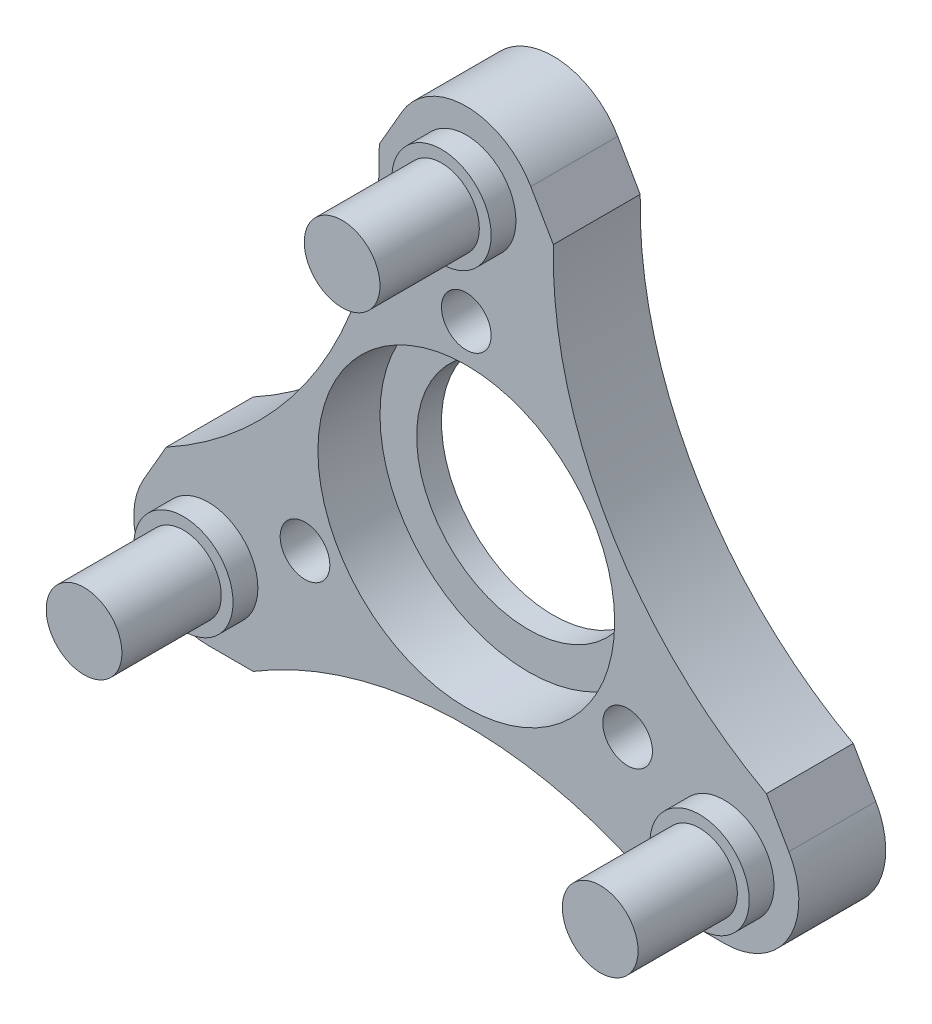
ISO-10303-21;
HEADER;
FILE_DESCRIPTION(('STEP AP214'),'2;1');
FILE_NAME('part.step','',(''),(''),'','','');
FILE_SCHEMA(('AUTOMOTIVE_DESIGN { 1 0 10303 214 1 1 1 1 }'));
ENDSEC;
DATA;
#1=APPLICATION_CONTEXT('core data for automotive mechanical design processes');
#2=APPLICATION_PROTOCOL_DEFINITION('international standard','automotive_design',2000,#1);
#3=PRODUCT_CONTEXT('',#1,'mechanical');
#4=PRODUCT('Part','Part','',(#3));
#5=PRODUCT_RELATED_PRODUCT_CATEGORY('part','',(#4));
#6=PRODUCT_DEFINITION_FORMATION('','',#4);
#7=PRODUCT_DEFINITION_CONTEXT('part definition',#1,'design');
#8=PRODUCT_DEFINITION('design','',#6,#7);
#9=PRODUCT_DEFINITION_SHAPE('','',#8);
#10=(LENGTH_UNIT() NAMED_UNIT(*) SI_UNIT(.MILLI.,.METRE.));
#11=(NAMED_UNIT(*) PLANE_ANGLE_UNIT() SI_UNIT($,.RADIAN.));
#12=(NAMED_UNIT(*) SI_UNIT($,.STERADIAN.) SOLID_ANGLE_UNIT());
#13=UNCERTAINTY_MEASURE_WITH_UNIT(LENGTH_MEASURE(1.E-05),#10,'distance_accuracy_value','');
#14=(GEOMETRIC_REPRESENTATION_CONTEXT(3) GLOBAL_UNCERTAINTY_ASSIGNED_CONTEXT((#13)) GLOBAL_UNIT_ASSIGNED_CONTEXT((#10,
#11,#12)) REPRESENTATION_CONTEXT('',''));
#15=CARTESIAN_POINT('',(0.,0.,0.));
#16=DIRECTION('',(0.,0.,1.));
#17=DIRECTION('',(1.,0.,0.));
#18=AXIS2_PLACEMENT_3D('',#15,#16,#17);
#19=CARTESIAN_POINT('',(7.79422863405997,4.50000000000006,2.5));
#20=DIRECTION('',(-0.866025403784436,-0.500000000000004,0.));
#21=DIRECTION('',(0.500000000000004,-0.866025403784436,0.));
#22=AXIS2_PLACEMENT_3D('',#19,#20,#21);
#23=PLANE('',#22);
#24=DIRECTION('',(0.500000000000004,-0.866025403784436,0.));
#25=VECTOR('',#24,1.);
#26=CARTESIAN_POINT('',(2.59807621135331,13.5,-1.));
#27=LINE('',#26,#25);
#28=CARTESIAN_POINT('',(12.0840089455446,-2.93011745279982,-1.));
#29=VERTEX_POINT('',#28);
#30=CARTESIAN_POINT('',(12.9903810567666,-4.49999999999989,-1.));
#31=VERTEX_POINT('',#30);
#32=EDGE_CURVE('E281',#29,#31,#27,.T.);
#33=ORIENTED_EDGE('',*,*,#32,.F.);
#34=DIRECTION('',(0.,0.,1.));
#35=VECTOR('',#34,1.);
#36=CARTESIAN_POINT('',(12.0840089455446,-2.93011745279982,-7.5));
#37=LINE('',#36,#35);
#38=CARTESIAN_POINT('',(12.0840089455446,-2.93011745279982,2.5));
#39=VERTEX_POINT('',#38);
#40=EDGE_CURVE('E107',#29,#39,#37,.T.);
#41=ORIENTED_EDGE('',*,*,#40,.T.);
#42=DIRECTION('',(-0.500000000000004,0.866025403784436,0.));
#43=VECTOR('',#42,1.);
#44=CARTESIAN_POINT('',(7.79422863405997,4.50000000000006,2.5));
#45=LINE('',#44,#43);
#46=CARTESIAN_POINT('',(12.9903810567666,-4.49999999999989,2.5));
#47=VERTEX_POINT('',#46);
#48=EDGE_CURVE('E208',#47,#39,#45,.T.);
#49=ORIENTED_EDGE('',*,*,#48,.F.);
#50=DIRECTION('',(0.,0.,-1.));
#51=VECTOR('',#50,1.);
#52=CARTESIAN_POINT('',(12.9903810567666,-4.49999999999989,2.5));
#53=LINE('',#52,#51);
#54=EDGE_CURVE('E227',#47,#31,#53,.T.);
#55=ORIENTED_EDGE('',*,*,#54,.T.);
#56=EDGE_LOOP('',(#33,#41,#49,#55));
#57=FACE_BOUND('',#56,.T.);
#58=ADVANCED_FACE('F92',(#57),#23,.F.);
#59=CARTESIAN_POINT('',(-7.7942286340599,4.49999999999987,2.5));
#60=DIRECTION('',(0.866025403784444,-0.499999999999991,0.));
#61=DIRECTION('',(0.499999999999991,0.866025403784444,0.));
#62=AXIS2_PLACEMENT_3D('',#59,#60,#61);
#63=PLANE('',#62);
#64=DIRECTION('',(0.499999999999991,0.866025403784444,0.));
#65=VECTOR('',#64,1.);
#66=CARTESIAN_POINT('',(-12.9903810567663,-4.49999999999993,-1.));
#67=LINE('',#66,#65);
#68=CARTESIAN_POINT('',(-3.50444832257553,11.9301174527996,-1.));
#69=VERTEX_POINT('',#68);
#70=CARTESIAN_POINT('',(-2.59807621135333,13.5,-1.));
#71=VERTEX_POINT('',#70);
#72=EDGE_CURVE('E194',#69,#71,#67,.T.);
#73=ORIENTED_EDGE('',*,*,#72,.F.);
#74=DIRECTION('',(0.,0.,1.));
#75=VECTOR('',#74,1.);
#76=CARTESIAN_POINT('',(-3.50444832257553,11.9301174527996,-7.5));
#77=LINE('',#76,#75);
#78=CARTESIAN_POINT('',(-3.50444832257553,11.9301174527996,2.5));
#79=VERTEX_POINT('',#78);
#80=EDGE_CURVE('E115',#69,#79,#77,.T.);
#81=ORIENTED_EDGE('',*,*,#80,.T.);
#82=DIRECTION('',(-0.499999999999991,-0.866025403784444,0.));
#83=VECTOR('',#82,1.);
#84=CARTESIAN_POINT('',(-7.7942286340599,4.49999999999987,2.5));
#85=LINE('',#84,#83);
#86=CARTESIAN_POINT('',(-2.59807621135333,13.5,2.5));
#87=VERTEX_POINT('',#86);
#88=EDGE_CURVE('E192',#87,#79,#85,.T.);
#89=ORIENTED_EDGE('',*,*,#88,.F.);
#90=DIRECTION('',(0.,0.,-1.));
#91=VECTOR('',#90,1.);
#92=CARTESIAN_POINT('',(-2.59807621135333,13.5,2.5));
#93=LINE('',#92,#91);
#94=EDGE_CURVE('E214',#87,#71,#93,.T.);
#95=ORIENTED_EDGE('',*,*,#94,.T.);
#96=EDGE_LOOP('',(#73,#81,#89,#95));
#97=FACE_BOUND('',#96,.T.);
#98=ADVANCED_FACE('F190',(#97),#63,.F.);
#99=CARTESIAN_POINT('',(0.,-8.9999999999999,2.5));
#100=DIRECTION('',(0.,1.,0.));
#101=DIRECTION('',(0.,0.,1.));
#102=AXIS2_PLACEMENT_3D('',#99,#100,#101);
#103=PLANE('',#102);
#104=DIRECTION('',(-1.,0.,0.));
#105=VECTOR('',#104,1.);
#106=CARTESIAN_POINT('',(10.3923048454133,-8.9999999999999,-1.));
#107=LINE('',#106,#105);
#108=CARTESIAN_POINT('',(-8.5795606229692,-8.9999999999999,-1.));
#109=VERTEX_POINT('',#108);
#110=CARTESIAN_POINT('',(-10.392304845413,-8.9999999999999,-1.));
#111=VERTEX_POINT('',#110);
#112=EDGE_CURVE('E353',#109,#111,#107,.T.);
#113=ORIENTED_EDGE('',*,*,#112,.F.);
#114=DIRECTION('',(0.,0.,1.));
#115=VECTOR('',#114,1.);
#116=CARTESIAN_POINT('',(-8.5795606229692,-8.9999999999999,-7.5));
#117=LINE('',#116,#115);
#118=CARTESIAN_POINT('',(-8.5795606229692,-8.9999999999999,2.5));
#119=VERTEX_POINT('',#118);
#120=EDGE_CURVE('E336',#109,#119,#117,.T.);
#121=ORIENTED_EDGE('',*,*,#120,.T.);
#122=DIRECTION('',(1.,0.,0.));
#123=VECTOR('',#122,1.);
#124=CARTESIAN_POINT('',(0.,-8.9999999999999,2.5));
#125=LINE('',#124,#123);
#126=CARTESIAN_POINT('',(-10.392304845413,-8.9999999999999,2.5));
#127=VERTEX_POINT('',#126);
#128=EDGE_CURVE('E308',#127,#119,#125,.T.);
#129=ORIENTED_EDGE('',*,*,#128,.F.);
#130=DIRECTION('',(0.,0.,-1.));
#131=VECTOR('',#130,1.);
#132=CARTESIAN_POINT('',(-10.392304845413,-8.9999999999999,2.5));
#133=LINE('',#132,#131);
#134=EDGE_CURVE('E206',#127,#111,#133,.T.);
#135=ORIENTED_EDGE('',*,*,#134,.T.);
#136=EDGE_LOOP('',(#113,#121,#129,#135));
#137=FACE_BOUND('',#136,.T.);
#138=ADVANCED_FACE('F376',(#137),#103,.F.);
#139=CARTESIAN_POINT('',(3.50444832257553,11.9301174527997,2.5));
#140=VERTEX_POINT('',#139);
#141=CARTESIAN_POINT('',(2.59807621135331,13.5,2.5));
#142=VERTEX_POINT('',#141);
#143=EDGE_CURVE('E273',#140,#142,#45,.T.);
#144=ORIENTED_EDGE('',*,*,#143,.F.);
#145=DIRECTION('',(0.,0.,1.));
#146=VECTOR('',#145,1.);
#147=CARTESIAN_POINT('',(3.50444832257553,11.9301174527997,-7.5));
#148=LINE('',#147,#146);
#149=CARTESIAN_POINT('',(3.50444832257553,11.9301174527997,-1.));
#150=VERTEX_POINT('',#149);
#151=EDGE_CURVE('E195',#140,#150,#148,.F.);
#152=ORIENTED_EDGE('',*,*,#151,.T.);
#153=CARTESIAN_POINT('',(2.59807621135331,13.5,-1.));
#154=VERTEX_POINT('',#153);
#155=EDGE_CURVE('E272',#154,#150,#27,.T.);
#156=ORIENTED_EDGE('',*,*,#155,.F.);
#157=DIRECTION('',(0.,0.,-1.));
#158=VECTOR('',#157,1.);
#159=CARTESIAN_POINT('',(2.59807621135331,13.5,2.5));
#160=LINE('',#159,#158);
#161=EDGE_CURVE('E224',#154,#142,#160,.F.);
#162=ORIENTED_EDGE('',*,*,#161,.T.);
#163=EDGE_LOOP('',(#144,#152,#156,#162));
#164=FACE_BOUND('',#163,.T.);
#165=ADVANCED_FACE('F271',(#164),#23,.F.);
#166=CARTESIAN_POINT('',(-12.0840089455441,-2.93011745279957,2.5));
#167=VERTEX_POINT('',#166);
#168=CARTESIAN_POINT('',(-12.9903810567663,-4.49999999999993,2.5));
#169=VERTEX_POINT('',#168);
#170=EDGE_CURVE('E203',#167,#169,#85,.T.);
#171=ORIENTED_EDGE('',*,*,#170,.F.);
#172=DIRECTION('',(0.,0.,1.));
#173=VECTOR('',#172,1.);
#174=CARTESIAN_POINT('',(-12.0840089455441,-2.93011745279957,-7.5));
#175=LINE('',#174,#173);
#176=CARTESIAN_POINT('',(-12.0840089455441,-2.93011745279957,-1.));
#177=VERTEX_POINT('',#176);
#178=EDGE_CURVE('E181',#167,#177,#175,.F.);
#179=ORIENTED_EDGE('',*,*,#178,.T.);
#180=CARTESIAN_POINT('',(-12.9903810567663,-4.49999999999993,-1.));
#181=VERTEX_POINT('',#180);
#182=EDGE_CURVE('E357',#181,#177,#67,.T.);
#183=ORIENTED_EDGE('',*,*,#182,.F.);
#184=DIRECTION('',(0.,0.,-1.));
#185=VECTOR('',#184,1.);
#186=CARTESIAN_POINT('',(-12.9903810567663,-4.49999999999993,2.5));
#187=LINE('',#186,#185);
#188=EDGE_CURVE('E216',#181,#169,#187,.F.);
#189=ORIENTED_EDGE('',*,*,#188,.T.);
#190=EDGE_LOOP('',(#171,#179,#183,#189));
#191=FACE_BOUND('',#190,.T.);
#192=ADVANCED_FACE('F378',(#191),#63,.F.);
#193=CARTESIAN_POINT('',(8.5795606229692,-8.9999999999999,2.5));
#194=VERTEX_POINT('',#193);
#195=CARTESIAN_POINT('',(10.3923048454133,-8.9999999999999,2.5));
#196=VERTEX_POINT('',#195);
#197=EDGE_CURVE('E307',#194,#196,#125,.T.);
#198=ORIENTED_EDGE('',*,*,#197,.F.);
#199=DIRECTION('',(0.,0.,1.));
#200=VECTOR('',#199,1.);
#201=CARTESIAN_POINT('',(8.5795606229692,-8.9999999999999,-7.5));
#202=LINE('',#201,#200);
#203=CARTESIAN_POINT('',(8.5795606229692,-8.9999999999999,-1.));
#204=VERTEX_POINT('',#203);
#205=EDGE_CURVE('E334',#194,#204,#202,.F.);
#206=ORIENTED_EDGE('',*,*,#205,.T.);
#207=CARTESIAN_POINT('',(10.3923048454133,-8.9999999999999,-1.));
#208=VERTEX_POINT('',#207);
#209=EDGE_CURVE('E321',#208,#204,#107,.T.);
#210=ORIENTED_EDGE('',*,*,#209,.F.);
#211=DIRECTION('',(0.,0.,-1.));
#212=VECTOR('',#211,1.);
#213=CARTESIAN_POINT('',(10.3923048454133,-8.9999999999999,2.5));
#214=LINE('',#213,#212);
#215=EDGE_CURVE('E202',#208,#196,#214,.F.);
#216=ORIENTED_EDGE('',*,*,#215,.T.);
#217=EDGE_LOOP('',(#198,#206,#210,#216));
#218=FACE_BOUND('',#217,.T.);
#219=ADVANCED_FACE('F319',(#218),#103,.F.);
#220=CARTESIAN_POINT('',(0.,0.,2.5));
#221=DIRECTION('',(0.,0.,1.));
#222=DIRECTION('',(1.,0.,0.));
#223=AXIS2_PLACEMENT_3D('',#220,#221,#222);
#224=PLANE('',#223);
#225=CARTESIAN_POINT('',(0.,-23.0940107675847,2.5));
#226=DIRECTION('',(0.,0.,1.));
#227=DIRECTION('',(1.,0.,0.));
#228=AXIS2_PLACEMENT_3D('',#225,#226,#227);
#229=CIRCLE('',#228,16.5);
#230=EDGE_CURVE('E315',#194,#119,#229,.T.);
#231=ORIENTED_EDGE('',*,*,#230,.F.);
#232=ORIENTED_EDGE('',*,*,#197,.T.);
#233=CARTESIAN_POINT('',(10.3923048454133,-5.9999999999999,2.5));
#234=DIRECTION('',(0.,0.,1.));
#235=DIRECTION('',(1.,0.,0.));
#236=AXIS2_PLACEMENT_3D('',#233,#234,#235);
#237=CIRCLE('',#236,3.);
#238=EDGE_CURVE('E220',#196,#47,#237,.T.);
#239=ORIENTED_EDGE('',*,*,#238,.T.);
#240=ORIENTED_EDGE('',*,*,#48,.T.);
#241=CARTESIAN_POINT('',(20.,11.5470053837925,2.5));
#242=DIRECTION('',(0.,0.,1.));
#243=DIRECTION('',(1.,0.,0.));
#244=AXIS2_PLACEMENT_3D('',#241,#242,#243);
#245=CIRCLE('',#244,16.5);
#246=EDGE_CURVE('E185',#140,#39,#245,.T.);
#247=ORIENTED_EDGE('',*,*,#246,.F.);
#248=ORIENTED_EDGE('',*,*,#143,.T.);
#249=CARTESIAN_POINT('',(0.,12.,2.5));
#250=DIRECTION('',(0.,0.,1.));
#251=DIRECTION('',(1.,0.,0.));
#252=AXIS2_PLACEMENT_3D('',#249,#250,#251);
#253=CIRCLE('',#252,3.);
#254=EDGE_CURVE('E201',#142,#87,#253,.T.);
#255=ORIENTED_EDGE('',*,*,#254,.T.);
#256=ORIENTED_EDGE('',*,*,#88,.T.);
#257=CARTESIAN_POINT('',(-20.,11.5470053837925,2.5));
#258=DIRECTION('',(0.,0.,1.));
#259=DIRECTION('',(1.,0.,0.));
#260=AXIS2_PLACEMENT_3D('',#257,#258,#259);
#261=CIRCLE('',#260,16.5);
#262=EDGE_CURVE('E178',#167,#79,#261,.T.);
#263=ORIENTED_EDGE('',*,*,#262,.F.);
#264=ORIENTED_EDGE('',*,*,#170,.T.);
#265=CARTESIAN_POINT('',(-10.392304845413,-5.9999999999999,2.5));
#266=DIRECTION('',(0.,0.,1.));
#267=DIRECTION('',(1.,0.,0.));
#268=AXIS2_PLACEMENT_3D('',#265,#266,#267);
#269=CIRCLE('',#268,3.);
#270=EDGE_CURVE('E222',#169,#127,#269,.T.);
#271=ORIENTED_EDGE('',*,*,#270,.T.);
#272=ORIENTED_EDGE('',*,*,#128,.T.);
#273=EDGE_LOOP('',(#231,#232,#239,#240,#247,#248,#255,#256,#263,#264,#271,#272));
#274=FACE_BOUND('',#273,.T.);
#275=CARTESIAN_POINT('',(0.,7.5,2.5));
#276=DIRECTION('',(0.,0.,1.));
#277=DIRECTION('',(1.,0.,0.));
#278=AXIS2_PLACEMENT_3D('',#275,#276,#277);
#279=CIRCLE('',#278,1.);
#280=CARTESIAN_POINT('',(1.,7.5,2.5));
#281=VERTEX_POINT('',#280);
#282=EDGE_CURVE('E255',#281,#281,#279,.T.);
#283=ORIENTED_EDGE('',*,*,#282,.F.);
#284=EDGE_LOOP('',(#283));
#285=FACE_BOUND('',#284,.T.);
#286=CARTESIAN_POINT('',(6.49519052838377,-3.74999999999972,2.5));
#287=DIRECTION('',(0.,0.,1.));
#288=DIRECTION('',(1.,0.,0.));
#289=AXIS2_PLACEMENT_3D('',#286,#287,#288);
#290=CIRCLE('',#289,1.00000000000041);
#291=CARTESIAN_POINT('',(7.49519052838418,-3.74999999999972,2.5));
#292=VERTEX_POINT('',#291);
#293=EDGE_CURVE('E342',#292,#292,#290,.T.);
#294=ORIENTED_EDGE('',*,*,#293,.F.);
#295=EDGE_LOOP('',(#294));
#296=FACE_BOUND('',#295,.T.);
#297=CARTESIAN_POINT('',(-6.49519052838281,-3.75000000000028,2.5));
#298=DIRECTION('',(0.,0.,1.));
#299=DIRECTION('',(1.,0.,0.));
#300=AXIS2_PLACEMENT_3D('',#297,#298,#299);
#301=CIRCLE('',#300,1.00000000000061);
#302=CARTESIAN_POINT('',(-5.4951905283822,-3.75000000000028,2.5));
#303=VERTEX_POINT('',#302);
#304=EDGE_CURVE('E339',#303,#303,#301,.T.);
#305=ORIENTED_EDGE('',*,*,#304,.F.);
#306=EDGE_LOOP('',(#305));
#307=FACE_BOUND('',#306,.T.);
#308=CARTESIAN_POINT('',(0.,0.,2.5));
#309=DIRECTION('',(0.,0.,1.));
#310=DIRECTION('',(1.,0.,0.));
#311=AXIS2_PLACEMENT_3D('',#308,#309,#310);
#312=CIRCLE('',#311,5.975);
#313=CARTESIAN_POINT('',(5.975,0.,2.5));
#314=VERTEX_POINT('',#313);
#315=EDGE_CURVE('E246',#314,#314,#312,.T.);
#316=ORIENTED_EDGE('',*,*,#315,.F.);
#317=EDGE_LOOP('',(#316));
#318=FACE_BOUND('',#317,.T.);
#319=CARTESIAN_POINT('',(-10.3923048454133,-6.,2.5));
#320=DIRECTION('',(0.,0.,1.));
#321=DIRECTION('',(1.,0.,0.));
#322=AXIS2_PLACEMENT_3D('',#319,#320,#321);
#323=CIRCLE('',#322,2.);
#324=CARTESIAN_POINT('',(-8.39230484541326,-6.,2.5));
#325=VERTEX_POINT('',#324);
#326=EDGE_CURVE('E249',#325,#325,#323,.T.);
#327=ORIENTED_EDGE('',*,*,#326,.F.);
#328=EDGE_LOOP('',(#327));
#329=FACE_BOUND('',#328,.T.);
#330=CARTESIAN_POINT('',(10.3923048454131,-5.9999999999999,2.5));
#331=DIRECTION('',(0.,0.,1.));
#332=DIRECTION('',(1.,0.,0.));
#333=AXIS2_PLACEMENT_3D('',#330,#331,#332);
#334=CIRCLE('',#333,2.);
#335=CARTESIAN_POINT('',(12.3923048454131,-5.9999999999999,2.5));
#336=VERTEX_POINT('',#335);
#337=EDGE_CURVE('E244',#336,#336,#334,.T.);
#338=ORIENTED_EDGE('',*,*,#337,.F.);
#339=EDGE_LOOP('',(#338));
#340=FACE_BOUND('',#339,.T.);
#341=CARTESIAN_POINT('',(0.,12.,2.5));
#342=DIRECTION('',(0.,0.,1.));
#343=DIRECTION('',(1.,0.,0.));
#344=AXIS2_PLACEMENT_3D('',#341,#342,#343);
#345=CIRCLE('',#344,2.);
#346=CARTESIAN_POINT('',(2.00000000000001,12.,2.5));
#347=VERTEX_POINT('',#346);
#348=EDGE_CURVE('E239',#347,#347,#345,.T.);
#349=ORIENTED_EDGE('',*,*,#348,.F.);
#350=EDGE_LOOP('',(#349));
#351=FACE_BOUND('',#350,.T.);
#352=ADVANCED_FACE('F198',(#274,#285,#296,#307,#318,#329,#340,#351),#224,.T.);
#353=CARTESIAN_POINT('',(-10.392304845413,-5.9999999999999,2.5));
#354=DIRECTION('',(0.,0.,-1.));
#355=DIRECTION('',(-1.,0.,0.));
#356=AXIS2_PLACEMENT_3D('',#353,#354,#355);
#357=CYLINDRICAL_SURFACE('',#356,3.);
#358=ORIENTED_EDGE('',*,*,#270,.F.);
#359=ORIENTED_EDGE('',*,*,#188,.F.);
#360=CARTESIAN_POINT('',(-10.392304845413,-5.9999999999999,-1.));
#361=DIRECTION('',(0.,0.,-1.));
#362=DIRECTION('',(-1.,0.,0.));
#363=AXIS2_PLACEMENT_3D('',#360,#361,#362);
#364=CIRCLE('',#363,3.);
#365=EDGE_CURVE('E355',#111,#181,#364,.T.);
#366=ORIENTED_EDGE('',*,*,#365,.F.);
#367=ORIENTED_EDGE('',*,*,#134,.F.);
#368=EDGE_LOOP('',(#358,#359,#366,#367));
#369=FACE_BOUND('',#368,.T.);
#370=ADVANCED_FACE('F370',(#369),#357,.T.);
#371=CARTESIAN_POINT('',(10.3923048454133,-5.9999999999999,2.5));
#372=DIRECTION('',(0.,0.,-1.));
#373=DIRECTION('',(-1.,0.,0.));
#374=AXIS2_PLACEMENT_3D('',#371,#372,#373);
#375=CYLINDRICAL_SURFACE('',#374,3.);
#376=ORIENTED_EDGE('',*,*,#238,.F.);
#377=ORIENTED_EDGE('',*,*,#215,.F.);
#378=CARTESIAN_POINT('',(10.3923048454133,-5.9999999999999,-1.));
#379=DIRECTION('',(0.,0.,-1.));
#380=DIRECTION('',(-1.,0.,0.));
#381=AXIS2_PLACEMENT_3D('',#378,#379,#380);
#382=CIRCLE('',#381,3.);
#383=EDGE_CURVE('E327',#31,#208,#382,.T.);
#384=ORIENTED_EDGE('',*,*,#383,.F.);
#385=ORIENTED_EDGE('',*,*,#54,.F.);
#386=EDGE_LOOP('',(#376,#377,#384,#385));
#387=FACE_BOUND('',#386,.T.);
#388=ADVANCED_FACE('F326',(#387),#375,.T.);
#389=CARTESIAN_POINT('',(0.,12.,2.5));
#390=DIRECTION('',(0.,0.,-1.));
#391=DIRECTION('',(-1.,0.,0.));
#392=AXIS2_PLACEMENT_3D('',#389,#390,#391);
#393=CYLINDRICAL_SURFACE('',#392,3.);
#394=ORIENTED_EDGE('',*,*,#254,.F.);
#395=ORIENTED_EDGE('',*,*,#161,.F.);
#396=CARTESIAN_POINT('',(0.,12.,-1.));
#397=DIRECTION('',(0.,0.,-1.));
#398=DIRECTION('',(-1.,0.,0.));
#399=AXIS2_PLACEMENT_3D('',#396,#397,#398);
#400=CIRCLE('',#399,3.);
#401=EDGE_CURVE('E280',#71,#154,#400,.T.);
#402=ORIENTED_EDGE('',*,*,#401,.F.);
#403=ORIENTED_EDGE('',*,*,#94,.F.);
#404=EDGE_LOOP('',(#394,#395,#402,#403));
#405=FACE_BOUND('',#404,.T.);
#406=ADVANCED_FACE('F94',(#405),#393,.T.);
#407=CARTESIAN_POINT('',(0.,12.,3.5));
#408=DIRECTION('',(0.,0.,-1.));
#409=DIRECTION('',(-1.,0.,0.));
#410=AXIS2_PLACEMENT_3D('',#407,#408,#409);
#411=CYLINDRICAL_SURFACE('',#410,2.);
#412=CARTESIAN_POINT('',(0.,12.,3.5));
#413=DIRECTION('',(0.,0.,1.));
#414=DIRECTION('',(1.,0.,0.));
#415=AXIS2_PLACEMENT_3D('',#412,#413,#414);
#416=CIRCLE('',#415,2.);
#417=CARTESIAN_POINT('',(2.00000000000001,12.,3.5));
#418=VERTEX_POINT('',#417);
#419=EDGE_CURVE('E235',#418,#418,#416,.T.);
#420=ORIENTED_EDGE('',*,*,#419,.F.);
#421=EDGE_LOOP('',(#420));
#422=FACE_BOUND('',#421,.T.);
#423=ORIENTED_EDGE('',*,*,#348,.T.);
#424=EDGE_LOOP('',(#423));
#425=FACE_BOUND('',#424,.T.);
#426=ADVANCED_FACE('F362',(#422,#425),#411,.T.);
#427=CARTESIAN_POINT('',(0.,12.,3.5));
#428=DIRECTION('',(0.,0.,1.));
#429=DIRECTION('',(1.,0.,0.));
#430=AXIS2_PLACEMENT_3D('',#427,#428,#429);
#431=PLANE('',#430);
#432=CARTESIAN_POINT('',(0.,12.,3.5));
#433=DIRECTION('',(0.,0.,1.));
#434=DIRECTION('',(1.,0.,0.));
#435=AXIS2_PLACEMENT_3D('',#432,#433,#434);
#436=CIRCLE('',#435,1.525);
#437=CARTESIAN_POINT('',(1.525,12.,3.5));
#438=VERTEX_POINT('',#437);
#439=EDGE_CURVE('E231',#438,#438,#436,.T.);
#440=ORIENTED_EDGE('',*,*,#439,.F.);
#441=EDGE_LOOP('',(#440));
#442=FACE_BOUND('',#441,.T.);
#443=ORIENTED_EDGE('',*,*,#419,.T.);
#444=EDGE_LOOP('',(#443));
#445=FACE_BOUND('',#444,.T.);
#446=ADVANCED_FACE('F367',(#442,#445),#431,.T.);
#447=CARTESIAN_POINT('',(0.,12.,7.5));
#448=DIRECTION('',(0.,0.,1.));
#449=DIRECTION('',(1.,0.,0.));
#450=AXIS2_PLACEMENT_3D('',#447,#448,#449);
#451=PLANE('',#450);
#452=CARTESIAN_POINT('',(0.,12.,7.5));
#453=DIRECTION('',(0.,0.,1.));
#454=DIRECTION('',(1.,0.,0.));
#455=AXIS2_PLACEMENT_3D('',#452,#453,#454);
#456=CIRCLE('',#455,1.525);
#457=CARTESIAN_POINT('',(1.525,12.,7.5));
#458=VERTEX_POINT('',#457);
#459=EDGE_CURVE('E305',#458,#458,#456,.T.);
#460=ORIENTED_EDGE('',*,*,#459,.T.);
#461=EDGE_LOOP('',(#460));
#462=FACE_BOUND('',#461,.T.);
#463=ADVANCED_FACE('F400',(#462),#451,.T.);
#464=CARTESIAN_POINT('',(0.,12.,7.5));
#465=DIRECTION('',(0.,0.,-1.));
#466=DIRECTION('',(-1.,0.,0.));
#467=AXIS2_PLACEMENT_3D('',#464,#465,#466);
#468=CYLINDRICAL_SURFACE('',#467,1.525);
#469=ORIENTED_EDGE('',*,*,#439,.T.);
#470=EDGE_LOOP('',(#469));
#471=FACE_BOUND('',#470,.T.);
#472=ORIENTED_EDGE('',*,*,#459,.F.);
#473=EDGE_LOOP('',(#472));
#474=FACE_BOUND('',#473,.T.);
#475=ADVANCED_FACE('F396',(#471,#474),#468,.T.);
#476=CARTESIAN_POINT('',(10.3923048454131,-5.9999999999999,3.5));
#477=DIRECTION('',(0.,0.,-1.));
#478=DIRECTION('',(-1.,0.,0.));
#479=AXIS2_PLACEMENT_3D('',#476,#477,#478);
#480=CYLINDRICAL_SURFACE('',#479,2.);
#481=CARTESIAN_POINT('',(10.3923048454131,-5.9999999999999,3.5));
#482=DIRECTION('',(0.,0.,1.));
#483=DIRECTION('',(1.,0.,0.));
#484=AXIS2_PLACEMENT_3D('',#481,#482,#483);
#485=CIRCLE('',#484,2.);
#486=CARTESIAN_POINT('',(12.3923048454131,-5.9999999999999,3.5));
#487=VERTEX_POINT('',#486);
#488=EDGE_CURVE('E240',#487,#487,#485,.T.);
#489=ORIENTED_EDGE('',*,*,#488,.F.);
#490=EDGE_LOOP('',(#489));
#491=FACE_BOUND('',#490,.T.);
#492=ORIENTED_EDGE('',*,*,#337,.T.);
#493=EDGE_LOOP('',(#492));
#494=FACE_BOUND('',#493,.T.);
#495=ADVANCED_FACE('F399',(#491,#494),#480,.T.);
#496=CARTESIAN_POINT('',(10.3923048454131,-5.9999999999999,3.5));
#497=DIRECTION('',(0.,0.,1.));
#498=DIRECTION('',(1.,0.,0.));
#499=AXIS2_PLACEMENT_3D('',#496,#497,#498);
#500=PLANE('',#499);
#501=CARTESIAN_POINT('',(10.3923048454131,-5.99999999999989,3.5));
#502=DIRECTION('',(0.,0.,1.));
#503=DIRECTION('',(1.,0.,0.));
#504=AXIS2_PLACEMENT_3D('',#501,#502,#503);
#505=CIRCLE('',#504,1.525);
#506=CARTESIAN_POINT('',(11.9173048454131,-5.99999999999989,3.5));
#507=VERTEX_POINT('',#506);
#508=EDGE_CURVE('E236',#507,#507,#505,.T.);
#509=ORIENTED_EDGE('',*,*,#508,.F.);
#510=EDGE_LOOP('',(#509));
#511=FACE_BOUND('',#510,.T.);
#512=ORIENTED_EDGE('',*,*,#488,.T.);
#513=EDGE_LOOP('',(#512));
#514=FACE_BOUND('',#513,.T.);
#515=ADVANCED_FACE('F413',(#511,#514),#500,.T.);
#516=CARTESIAN_POINT('',(10.3923048454131,-5.99999999999989,7.5));
#517=DIRECTION('',(0.,0.,1.));
#518=DIRECTION('',(1.,0.,0.));
#519=AXIS2_PLACEMENT_3D('',#516,#517,#518);
#520=PLANE('',#519);
#521=CARTESIAN_POINT('',(10.3923048454131,-5.99999999999989,7.5));
#522=DIRECTION('',(0.,0.,1.));
#523=DIRECTION('',(1.,0.,0.));
#524=AXIS2_PLACEMENT_3D('',#521,#522,#523);
#525=CIRCLE('',#524,1.525);
#526=CARTESIAN_POINT('',(11.9173048454131,-5.99999999999989,7.5));
#527=VERTEX_POINT('',#526);
#528=EDGE_CURVE('E302',#527,#527,#525,.T.);
#529=ORIENTED_EDGE('',*,*,#528,.T.);
#530=EDGE_LOOP('',(#529));
#531=FACE_BOUND('',#530,.T.);
#532=ADVANCED_FACE('F409',(#531),#520,.T.);
#533=CARTESIAN_POINT('',(10.3923048454131,-5.99999999999989,7.5));
#534=DIRECTION('',(0.,0.,-1.));
#535=DIRECTION('',(-1.,0.,0.));
#536=AXIS2_PLACEMENT_3D('',#533,#534,#535);
#537=CYLINDRICAL_SURFACE('',#536,1.525);
#538=ORIENTED_EDGE('',*,*,#508,.T.);
#539=EDGE_LOOP('',(#538));
#540=FACE_BOUND('',#539,.T.);
#541=ORIENTED_EDGE('',*,*,#528,.F.);
#542=EDGE_LOOP('',(#541));
#543=FACE_BOUND('',#542,.T.);
#544=ADVANCED_FACE('F405',(#540,#543),#537,.T.);
#545=CARTESIAN_POINT('',(-10.3923048454133,-6.,3.5));
#546=DIRECTION('',(0.,0.,-1.));
#547=DIRECTION('',(-1.,0.,0.));
#548=AXIS2_PLACEMENT_3D('',#545,#546,#547);
#549=CYLINDRICAL_SURFACE('',#548,2.);
#550=CARTESIAN_POINT('',(-10.3923048454133,-6.,3.5));
#551=DIRECTION('',(0.,0.,1.));
#552=DIRECTION('',(1.,0.,0.));
#553=AXIS2_PLACEMENT_3D('',#550,#551,#552);
#554=CIRCLE('',#553,2.);
#555=CARTESIAN_POINT('',(-8.39230484541326,-6.,3.5));
#556=VERTEX_POINT('',#555);
#557=EDGE_CURVE('E245',#556,#556,#554,.T.);
#558=ORIENTED_EDGE('',*,*,#557,.F.);
#559=EDGE_LOOP('',(#558));
#560=FACE_BOUND('',#559,.T.);
#561=ORIENTED_EDGE('',*,*,#326,.T.);
#562=EDGE_LOOP('',(#561));
#563=FACE_BOUND('',#562,.T.);
#564=ADVANCED_FACE('F408',(#560,#563),#549,.T.);
#565=CARTESIAN_POINT('',(-10.3923048454133,-6.,3.5));
#566=DIRECTION('',(0.,0.,1.));
#567=DIRECTION('',(1.,0.,0.));
#568=AXIS2_PLACEMENT_3D('',#565,#566,#567);
#569=PLANE('',#568);
#570=CARTESIAN_POINT('',(-10.3923048454133,-6.,3.5));
#571=DIRECTION('',(0.,0.,1.));
#572=DIRECTION('',(1.,0.,0.));
#573=AXIS2_PLACEMENT_3D('',#570,#571,#572);
#574=CIRCLE('',#573,1.525);
#575=CARTESIAN_POINT('',(-8.86730484541327,-6.,3.5));
#576=VERTEX_POINT('',#575);
#577=EDGE_CURVE('E241',#576,#576,#574,.T.);
#578=ORIENTED_EDGE('',*,*,#577,.F.);
#579=EDGE_LOOP('',(#578));
#580=FACE_BOUND('',#579,.T.);
#581=ORIENTED_EDGE('',*,*,#557,.T.);
#582=EDGE_LOOP('',(#581));
#583=FACE_BOUND('',#582,.T.);
#584=ADVANCED_FACE('F422',(#580,#583),#569,.T.);
#585=CARTESIAN_POINT('',(-10.3923048454133,-6.,7.5));
#586=DIRECTION('',(0.,0.,1.));
#587=DIRECTION('',(1.,0.,0.));
#588=AXIS2_PLACEMENT_3D('',#585,#586,#587);
#589=PLANE('',#588);
#590=CARTESIAN_POINT('',(-10.3923048454133,-6.,7.5));
#591=DIRECTION('',(0.,0.,1.));
#592=DIRECTION('',(1.,0.,0.));
#593=AXIS2_PLACEMENT_3D('',#590,#591,#592);
#594=CIRCLE('',#593,1.525);
#595=CARTESIAN_POINT('',(-8.86730484541327,-6.,7.5));
#596=VERTEX_POINT('',#595);
#597=EDGE_CURVE('E234',#596,#596,#594,.T.);
#598=ORIENTED_EDGE('',*,*,#597,.T.);
#599=EDGE_LOOP('',(#598));
#600=FACE_BOUND('',#599,.T.);
#601=ADVANCED_FACE('F419',(#600),#589,.T.);
#602=CARTESIAN_POINT('',(-10.3923048454133,-6.,7.5));
#603=DIRECTION('',(0.,0.,-1.));
#604=DIRECTION('',(-1.,0.,0.));
#605=AXIS2_PLACEMENT_3D('',#602,#603,#604);
#606=CYLINDRICAL_SURFACE('',#605,1.525);
#607=ORIENTED_EDGE('',*,*,#577,.T.);
#608=EDGE_LOOP('',(#607));
#609=FACE_BOUND('',#608,.T.);
#610=ORIENTED_EDGE('',*,*,#597,.F.);
#611=EDGE_LOOP('',(#610));
#612=FACE_BOUND('',#611,.T.);
#613=ADVANCED_FACE('F415',(#609,#612),#606,.T.);
#614=CARTESIAN_POINT('',(0.,0.,10.));
#615=DIRECTION('',(0.,0.,-1.));
#616=DIRECTION('',(-1.,0.,0.));
#617=AXIS2_PLACEMENT_3D('',#614,#615,#616);
#618=CYLINDRICAL_SURFACE('',#617,5.975);
#619=ORIENTED_EDGE('',*,*,#315,.T.);
#620=EDGE_LOOP('',(#619));
#621=FACE_BOUND('',#620,.T.);
#622=CARTESIAN_POINT('',(0.,0.,0.));
#623=DIRECTION('',(0.,0.,-1.));
#624=DIRECTION('',(-1.,0.,0.));
#625=AXIS2_PLACEMENT_3D('',#622,#623,#624);
#626=CIRCLE('',#625,5.975);
#627=CARTESIAN_POINT('',(-5.975,0.,0.));
#628=VERTEX_POINT('',#627);
#629=EDGE_CURVE('E250',#628,#628,#626,.T.);
#630=ORIENTED_EDGE('',*,*,#629,.T.);
#631=EDGE_LOOP('',(#630));
#632=FACE_BOUND('',#631,.T.);
#633=ADVANCED_FACE('F418',(#621,#632),#618,.F.);
#634=CARTESIAN_POINT('',(10.3923048454133,-5.9999999999999,0.));
#635=DIRECTION('',(0.,0.,-1.));
#636=DIRECTION('',(-1.,0.,0.));
#637=AXIS2_PLACEMENT_3D('',#634,#635,#636);
#638=PLANE('',#637);
#639=CARTESIAN_POINT('',(0.,0.,0.));
#640=DIRECTION('',(0.,0.,1.));
#641=DIRECTION('',(1.,0.,0.));
#642=AXIS2_PLACEMENT_3D('',#639,#640,#641);
#643=CIRCLE('',#642,4.5);
#644=CARTESIAN_POINT('',(4.5,0.,0.));
#645=VERTEX_POINT('',#644);
#646=EDGE_CURVE('E261',#645,#645,#643,.T.);
#647=ORIENTED_EDGE('',*,*,#646,.F.);
#648=EDGE_LOOP('',(#647));
#649=FACE_BOUND('',#648,.T.);
#650=ORIENTED_EDGE('',*,*,#629,.F.);
#651=EDGE_LOOP('',(#650));
#652=FACE_BOUND('',#651,.T.);
#653=ADVANCED_FACE('F442',(#649,#652),#638,.F.);
#654=CARTESIAN_POINT('',(10.3923048454133,-5.9999999999999,-1.));
#655=DIRECTION('',(0.,0.,-1.));
#656=DIRECTION('',(-1.,0.,0.));
#657=AXIS2_PLACEMENT_3D('',#654,#655,#656);
#658=PLANE('',#657);
#659=CARTESIAN_POINT('',(0.,-23.0940107675847,-1.));
#660=DIRECTION('',(0.,0.,-1.));
#661=DIRECTION('',(-1.,0.,0.));
#662=AXIS2_PLACEMENT_3D('',#659,#660,#661);
#663=CIRCLE('',#662,16.5);
#664=EDGE_CURVE('E12',#109,#204,#663,.T.);
#665=ORIENTED_EDGE('',*,*,#664,.F.);
#666=ORIENTED_EDGE('',*,*,#112,.T.);
#667=ORIENTED_EDGE('',*,*,#365,.T.);
#668=ORIENTED_EDGE('',*,*,#182,.T.);
#669=CARTESIAN_POINT('',(-20.,11.5470053837925,-1.));
#670=DIRECTION('',(0.,0.,-1.));
#671=DIRECTION('',(-1.,0.,0.));
#672=AXIS2_PLACEMENT_3D('',#669,#670,#671);
#673=CIRCLE('',#672,16.5);
#674=EDGE_CURVE('E230',#69,#177,#673,.T.);
#675=ORIENTED_EDGE('',*,*,#674,.F.);
#676=ORIENTED_EDGE('',*,*,#72,.T.);
#677=ORIENTED_EDGE('',*,*,#401,.T.);
#678=ORIENTED_EDGE('',*,*,#155,.T.);
#679=CARTESIAN_POINT('',(20.,11.5470053837925,-1.));
#680=DIRECTION('',(0.,0.,-1.));
#681=DIRECTION('',(-1.,0.,0.));
#682=AXIS2_PLACEMENT_3D('',#679,#680,#681);
#683=CIRCLE('',#682,16.5);
#684=EDGE_CURVE('E100',#29,#150,#683,.T.);
#685=ORIENTED_EDGE('',*,*,#684,.F.);
#686=ORIENTED_EDGE('',*,*,#32,.T.);
#687=ORIENTED_EDGE('',*,*,#383,.T.);
#688=ORIENTED_EDGE('',*,*,#209,.T.);
#689=EDGE_LOOP('',(#665,#666,#667,#668,#675,#676,#677,#678,#685,#686,#687,#688));
#690=FACE_BOUND('',#689,.T.);
#691=CARTESIAN_POINT('',(0.,7.5,-1.));
#692=DIRECTION('',(0.,0.,-1.));
#693=DIRECTION('',(-1.,0.,0.));
#694=AXIS2_PLACEMENT_3D('',#691,#692,#693);
#695=CIRCLE('',#694,1.);
#696=CARTESIAN_POINT('',(-1.,7.5,-1.));
#697=VERTEX_POINT('',#696);
#698=EDGE_CURVE('E258',#697,#697,#695,.T.);
#699=ORIENTED_EDGE('',*,*,#698,.F.);
#700=EDGE_LOOP('',(#699));
#701=FACE_BOUND('',#700,.T.);
#702=CARTESIAN_POINT('',(6.49519052838377,-3.74999999999972,-1.));
#703=DIRECTION('',(0.,0.,-1.));
#704=DIRECTION('',(-1.,0.,0.));
#705=AXIS2_PLACEMENT_3D('',#702,#703,#704);
#706=CIRCLE('',#705,1.00000000000041);
#707=CARTESIAN_POINT('',(5.49519052838336,-3.74999999999972,-1.));
#708=VERTEX_POINT('',#707);
#709=EDGE_CURVE('E254',#708,#708,#706,.T.);
#710=ORIENTED_EDGE('',*,*,#709,.F.);
#711=EDGE_LOOP('',(#710));
#712=FACE_BOUND('',#711,.T.);
#713=CARTESIAN_POINT('',(-6.49519052838281,-3.75000000000028,-1.));
#714=DIRECTION('',(0.,0.,-1.));
#715=DIRECTION('',(-1.,0.,0.));
#716=AXIS2_PLACEMENT_3D('',#713,#714,#715);
#717=CIRCLE('',#716,1.00000000000061);
#718=CARTESIAN_POINT('',(-7.49519052838342,-3.75000000000028,-1.));
#719=VERTEX_POINT('',#718);
#720=EDGE_CURVE('E251',#719,#719,#717,.T.);
#721=ORIENTED_EDGE('',*,*,#720,.F.);
#722=EDGE_LOOP('',(#721));
#723=FACE_BOUND('',#722,.T.);
#724=CARTESIAN_POINT('',(0.,0.,-1.));
#725=DIRECTION('',(0.,0.,1.));
#726=DIRECTION('',(1.,0.,0.));
#727=AXIS2_PLACEMENT_3D('',#724,#725,#726);
#728=CIRCLE('',#727,4.5);
#729=CARTESIAN_POINT('',(4.5,0.,-1.));
#730=VERTEX_POINT('',#729);
#731=EDGE_CURVE('E347',#730,#730,#728,.T.);
#732=ORIENTED_EDGE('',*,*,#731,.T.);
#733=EDGE_LOOP('',(#732));
#734=FACE_BOUND('',#733,.T.);
#735=ADVANCED_FACE('F277',(#690,#701,#712,#723,#734),#658,.T.);
#736=CARTESIAN_POINT('',(0.,0.,-1.));
#737=DIRECTION('',(0.,0.,1.));
#738=DIRECTION('',(1.,0.,0.));
#739=AXIS2_PLACEMENT_3D('',#736,#737,#738);
#740=CYLINDRICAL_SURFACE('',#739,4.5);
#741=ORIENTED_EDGE('',*,*,#731,.F.);
#742=EDGE_LOOP('',(#741));
#743=FACE_BOUND('',#742,.T.);
#744=ORIENTED_EDGE('',*,*,#646,.T.);
#745=EDGE_LOOP('',(#744));
#746=FACE_BOUND('',#745,.T.);
#747=ADVANCED_FACE('F449',(#743,#746),#740,.F.);
#748=CARTESIAN_POINT('',(-6.49519052838281,-3.75000000000028,-7.5));
#749=DIRECTION('',(0.,0.,1.));
#750=DIRECTION('',(1.,0.,0.));
#751=AXIS2_PLACEMENT_3D('',#748,#749,#750);
#752=CYLINDRICAL_SURFACE('',#751,1.00000000000061);
#753=ORIENTED_EDGE('',*,*,#720,.T.);
#754=EDGE_LOOP('',(#753));
#755=FACE_BOUND('',#754,.T.);
#756=ORIENTED_EDGE('',*,*,#304,.T.);
#757=EDGE_LOOP('',(#756));
#758=FACE_BOUND('',#757,.T.);
#759=ADVANCED_FACE('F452',(#755,#758),#752,.F.);
#760=CARTESIAN_POINT('',(6.49519052838377,-3.74999999999972,-7.5));
#761=DIRECTION('',(0.,0.,1.));
#762=DIRECTION('',(1.,0.,0.));
#763=AXIS2_PLACEMENT_3D('',#760,#761,#762);
#764=CYLINDRICAL_SURFACE('',#763,1.00000000000041);
#765=ORIENTED_EDGE('',*,*,#709,.T.);
#766=EDGE_LOOP('',(#765));
#767=FACE_BOUND('',#766,.T.);
#768=ORIENTED_EDGE('',*,*,#293,.T.);
#769=EDGE_LOOP('',(#768));
#770=FACE_BOUND('',#769,.T.);
#771=ADVANCED_FACE('F456',(#767,#770),#764,.F.);
#772=CARTESIAN_POINT('',(0.,7.5,-7.5));
#773=DIRECTION('',(0.,0.,1.));
#774=DIRECTION('',(1.,0.,0.));
#775=AXIS2_PLACEMENT_3D('',#772,#773,#774);
#776=CYLINDRICAL_SURFACE('',#775,1.);
#777=ORIENTED_EDGE('',*,*,#698,.T.);
#778=EDGE_LOOP('',(#777));
#779=FACE_BOUND('',#778,.T.);
#780=ORIENTED_EDGE('',*,*,#282,.T.);
#781=EDGE_LOOP('',(#780));
#782=FACE_BOUND('',#781,.T.);
#783=ADVANCED_FACE('F460',(#779,#782),#776,.F.);
#784=CARTESIAN_POINT('',(-20.,11.5470053837925,-7.5));
#785=DIRECTION('',(0.,0.,1.));
#786=DIRECTION('',(1.,0.,0.));
#787=AXIS2_PLACEMENT_3D('',#784,#785,#786);
#788=CYLINDRICAL_SURFACE('',#787,16.5);
#789=ORIENTED_EDGE('',*,*,#674,.T.);
#790=ORIENTED_EDGE('',*,*,#178,.F.);
#791=ORIENTED_EDGE('',*,*,#262,.T.);
#792=ORIENTED_EDGE('',*,*,#80,.F.);
#793=EDGE_LOOP('',(#789,#790,#791,#792));
#794=FACE_BOUND('',#793,.T.);
#795=ADVANCED_FACE('F179',(#794),#788,.F.);
#796=CARTESIAN_POINT('',(20.,11.5470053837925,-7.5));
#797=DIRECTION('',(0.,0.,1.));
#798=DIRECTION('',(1.,0.,0.));
#799=AXIS2_PLACEMENT_3D('',#796,#797,#798);
#800=CYLINDRICAL_SURFACE('',#799,16.5);
#801=ORIENTED_EDGE('',*,*,#684,.T.);
#802=ORIENTED_EDGE('',*,*,#151,.F.);
#803=ORIENTED_EDGE('',*,*,#246,.T.);
#804=ORIENTED_EDGE('',*,*,#40,.F.);
#805=EDGE_LOOP('',(#801,#802,#803,#804));
#806=FACE_BOUND('',#805,.T.);
#807=ADVANCED_FACE('F263',(#806),#800,.F.);
#808=CARTESIAN_POINT('',(0.,-23.0940107675847,-7.5));
#809=DIRECTION('',(0.,0.,1.));
#810=DIRECTION('',(1.,0.,0.));
#811=AXIS2_PLACEMENT_3D('',#808,#809,#810);
#812=CYLINDRICAL_SURFACE('',#811,16.5);
#813=ORIENTED_EDGE('',*,*,#664,.T.);
#814=ORIENTED_EDGE('',*,*,#205,.F.);
#815=ORIENTED_EDGE('',*,*,#230,.T.);
#816=ORIENTED_EDGE('',*,*,#120,.F.);
#817=EDGE_LOOP('',(#813,#814,#815,#816));
#818=FACE_BOUND('',#817,.T.);
#819=ADVANCED_FACE('F467',(#818),#812,.F.);
#820=CLOSED_SHELL('',(#58,#98,#138,#165,#192,#219,#352,#370,#388,#406,#426,#446,#463,#475,#495,
#515,#532,#544,#564,#584,#601,#613,#633,#653,#735,#747,#759,#771,#783,#795,#807,#819));
#821=MANIFOLD_SOLID_BREP('B2',#820);
#822=ADVANCED_BREP_SHAPE_REPRESENTATION('',(#18,#821),#14);
#823=SHAPE_DEFINITION_REPRESENTATION(#9,#822);
ENDSEC;
END-ISO-10303-21;
